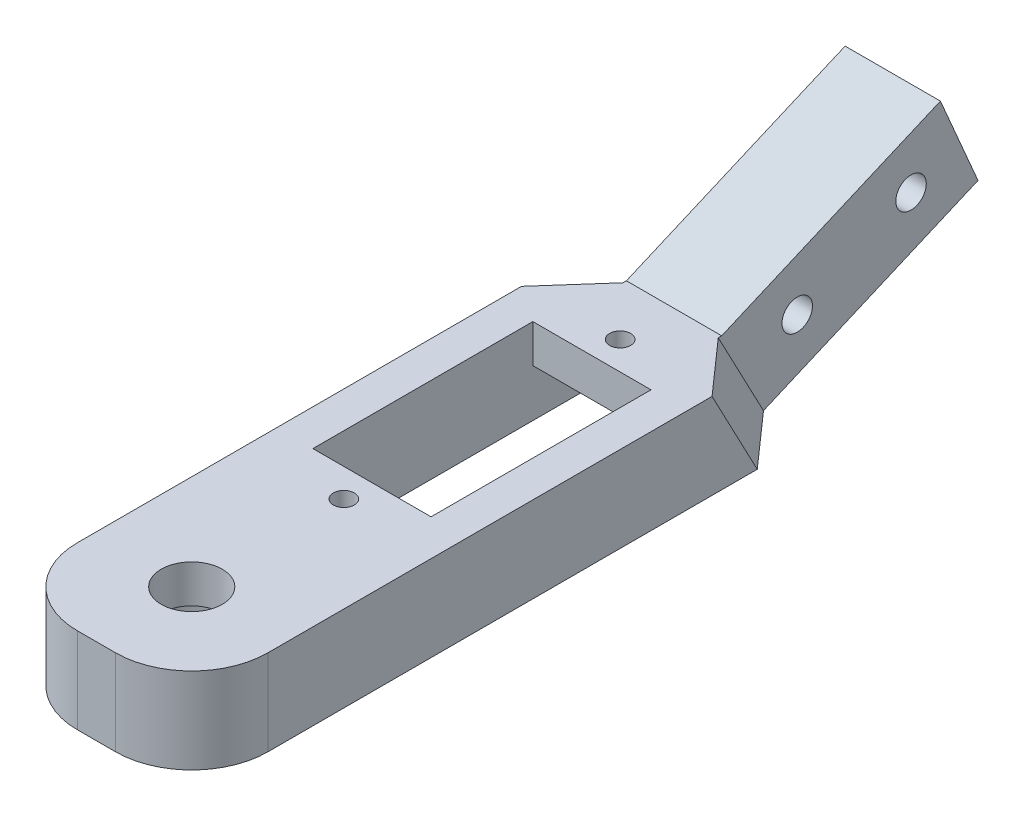
ISO-10303-21;
HEADER;
FILE_DESCRIPTION(('STEP AP214'),'2;1');
FILE_NAME('part.step','',(''),(''),'','','');
FILE_SCHEMA(('AUTOMOTIVE_DESIGN { 1 0 10303 214 1 1 1 1 }'));
ENDSEC;
DATA;
#1=APPLICATION_CONTEXT('core data for automotive mechanical design processes');
#2=APPLICATION_PROTOCOL_DEFINITION('international standard','automotive_design',2000,#1);
#3=PRODUCT_CONTEXT('',#1,'mechanical');
#4=PRODUCT('Part','Part','',(#3));
#5=PRODUCT_RELATED_PRODUCT_CATEGORY('part','',(#4));
#6=PRODUCT_DEFINITION_FORMATION('','',#4);
#7=PRODUCT_DEFINITION_CONTEXT('part definition',#1,'design');
#8=PRODUCT_DEFINITION('design','',#6,#7);
#9=PRODUCT_DEFINITION_SHAPE('','',#8);
#10=(LENGTH_UNIT() NAMED_UNIT(*) SI_UNIT(.MILLI.,.METRE.));
#11=(NAMED_UNIT(*) PLANE_ANGLE_UNIT() SI_UNIT($,.RADIAN.));
#12=(NAMED_UNIT(*) SI_UNIT($,.STERADIAN.) SOLID_ANGLE_UNIT());
#13=UNCERTAINTY_MEASURE_WITH_UNIT(LENGTH_MEASURE(1.E-05),#10,'distance_accuracy_value','');
#14=(GEOMETRIC_REPRESENTATION_CONTEXT(3) GLOBAL_UNCERTAINTY_ASSIGNED_CONTEXT((#13)) GLOBAL_UNIT_ASSIGNED_CONTEXT((#10,
#11,#12)) REPRESENTATION_CONTEXT('',''));
#15=CARTESIAN_POINT('',(0.,0.,0.));
#16=DIRECTION('',(0.,0.,1.));
#17=DIRECTION('',(1.,0.,0.));
#18=AXIS2_PLACEMENT_3D('',#15,#16,#17);
#19=CARTESIAN_POINT('',(6.2,-4.,-42.));
#20=DIRECTION('',(0.,0.,-1.));
#21=DIRECTION('',(0.,1.,0.));
#22=AXIS2_PLACEMENT_3D('',#19,#20,#21);
#23=PLANE('',#22);
#24=DIRECTION('',(-1.,0.,0.));
#25=VECTOR('',#24,1.);
#26=CARTESIAN_POINT('',(6.2,1.00000000000001,-42.));
#27=LINE('',#26,#25);
#28=CARTESIAN_POINT('',(6.2,1.00000000000001,-42.));
#29=VERTEX_POINT('',#28);
#30=CARTESIAN_POINT('',(-6.2,1.00000000000001,-42.));
#31=VERTEX_POINT('',#30);
#32=EDGE_CURVE('E278',#29,#31,#27,.T.);
#33=ORIENTED_EDGE('',*,*,#32,.F.);
#34=DIRECTION('',(0.,1.,0.));
#35=VECTOR('',#34,1.);
#36=CARTESIAN_POINT('',(6.2,-4.,-42.));
#37=LINE('',#36,#35);
#38=CARTESIAN_POINT('',(6.2,5.00000000000001,-42.));
#39=VERTEX_POINT('',#38);
#40=EDGE_CURVE('E262',#29,#39,#37,.T.);
#41=ORIENTED_EDGE('',*,*,#40,.T.);
#42=DIRECTION('',(-1.,0.,0.));
#43=VECTOR('',#42,1.);
#44=CARTESIAN_POINT('',(6.2,5.00000000000001,-42.));
#45=LINE('',#44,#43);
#46=CARTESIAN_POINT('',(-6.2,5.00000000000001,-42.));
#47=VERTEX_POINT('',#46);
#48=EDGE_CURVE('E265',#39,#47,#45,.T.);
#49=ORIENTED_EDGE('',*,*,#48,.T.);
#50=DIRECTION('',(0.,1.,0.));
#51=VECTOR('',#50,1.);
#52=CARTESIAN_POINT('',(-6.2,-4.,-42.));
#53=LINE('',#52,#51);
#54=EDGE_CURVE('E254',#31,#47,#53,.T.);
#55=ORIENTED_EDGE('',*,*,#54,.F.);
#56=EDGE_LOOP('',(#33,#41,#49,#55));
#57=FACE_BOUND('',#56,.T.);
#58=ADVANCED_FACE('F39',(#57),#23,.F.);
#59=CARTESIAN_POINT('',(6.2,-4.,-18.9147427120666));
#60=DIRECTION('',(0.,0.,1.));
#61=DIRECTION('',(0.,-1.,0.));
#62=AXIS2_PLACEMENT_3D('',#59,#60,#61);
#63=PLANE('',#62);
#64=DIRECTION('',(1.,0.,0.));
#65=VECTOR('',#64,1.);
#66=CARTESIAN_POINT('',(6.2,1.00000000000001,-18.9147427120666));
#67=LINE('',#66,#65);
#68=CARTESIAN_POINT('',(-6.2,1.00000000000001,-18.9147427120666));
#69=VERTEX_POINT('',#68);
#70=CARTESIAN_POINT('',(6.2,1.,-18.9147427120666));
#71=VERTEX_POINT('',#70);
#72=EDGE_CURVE('E228',#69,#71,#67,.T.);
#73=ORIENTED_EDGE('',*,*,#72,.F.);
#74=DIRECTION('',(0.,1.,0.));
#75=VECTOR('',#74,1.);
#76=CARTESIAN_POINT('',(-6.2,-4.,-18.9147427120666));
#77=LINE('',#76,#75);
#78=CARTESIAN_POINT('',(-6.2,5.00000000000001,-18.9147427120666));
#79=VERTEX_POINT('',#78);
#80=EDGE_CURVE('E257',#69,#79,#77,.T.);
#81=ORIENTED_EDGE('',*,*,#80,.T.);
#82=DIRECTION('',(1.,0.,0.));
#83=VECTOR('',#82,1.);
#84=CARTESIAN_POINT('',(6.2,5.,-18.9147427120666));
#85=LINE('',#84,#83);
#86=CARTESIAN_POINT('',(6.2,5.,-18.9147427120666));
#87=VERTEX_POINT('',#86);
#88=EDGE_CURVE('E272',#79,#87,#85,.T.);
#89=ORIENTED_EDGE('',*,*,#88,.T.);
#90=DIRECTION('',(0.,1.,0.));
#91=VECTOR('',#90,1.);
#92=CARTESIAN_POINT('',(6.2,-4.,-18.9147427120666));
#93=LINE('',#92,#91);
#94=EDGE_CURVE('E259',#71,#87,#93,.T.);
#95=ORIENTED_EDGE('',*,*,#94,.F.);
#96=EDGE_LOOP('',(#73,#81,#89,#95));
#97=FACE_BOUND('',#96,.T.);
#98=ADVANCED_FACE('F376',(#97),#63,.F.);
#99=CARTESIAN_POINT('',(10.,-3.99999999999999,10.));
#100=DIRECTION('',(0.,0.,-1.));
#101=DIRECTION('',(0.,1.,0.));
#102=AXIS2_PLACEMENT_3D('',#99,#100,#101);
#103=PLANE('',#102);
#104=DIRECTION('',(-1.,0.,0.));
#105=VECTOR('',#104,1.);
#106=CARTESIAN_POINT('',(10.,5.,10.));
#107=LINE('',#106,#105);
#108=CARTESIAN_POINT('',(2.,5.,10.));
#109=VERTEX_POINT('',#108);
#110=CARTESIAN_POINT('',(-2.,5.,10.));
#111=VERTEX_POINT('',#110);
#112=EDGE_CURVE('E233',#109,#111,#107,.T.);
#113=ORIENTED_EDGE('',*,*,#112,.T.);
#114=DIRECTION('',(0.,-1.,0.));
#115=VECTOR('',#114,1.);
#116=CARTESIAN_POINT('',(-2.,-3.99999999999999,10.));
#117=LINE('',#116,#115);
#118=CARTESIAN_POINT('',(-2.,-3.99999999999999,10.));
#119=VERTEX_POINT('',#118);
#120=EDGE_CURVE('E223',#111,#119,#117,.T.);
#121=ORIENTED_EDGE('',*,*,#120,.T.);
#122=DIRECTION('',(-1.,0.,0.));
#123=VECTOR('',#122,1.);
#124=CARTESIAN_POINT('',(10.,-3.99999999999999,10.));
#125=LINE('',#124,#123);
#126=CARTESIAN_POINT('',(2.,-3.99999999999999,10.));
#127=VERTEX_POINT('',#126);
#128=EDGE_CURVE('E230',#127,#119,#125,.T.);
#129=ORIENTED_EDGE('',*,*,#128,.F.);
#130=DIRECTION('',(0.,-1.,0.));
#131=VECTOR('',#130,1.);
#132=CARTESIAN_POINT('',(2.,5.,10.));
#133=LINE('',#132,#131);
#134=EDGE_CURVE('E226',#127,#109,#133,.F.);
#135=ORIENTED_EDGE('',*,*,#134,.T.);
#136=EDGE_LOOP('',(#113,#121,#129,#135));
#137=FACE_BOUND('',#136,.T.);
#138=ADVANCED_FACE('F382',(#137),#103,.F.);
#139=CARTESIAN_POINT('',(10.,-3.99999999999999,-55.));
#140=DIRECTION('',(0.,1.,0.));
#141=DIRECTION('',(0.,0.,1.));
#142=AXIS2_PLACEMENT_3D('',#139,#140,#141);
#143=PLANE('',#142);
#144=DIRECTION('',(0.,0.,1.));
#145=VECTOR('',#144,1.);
#146=CARTESIAN_POINT('',(-6.2,-4.,-42.));
#147=LINE('',#146,#145);
#148=CARTESIAN_POINT('',(-6.2,-3.99999999999998,-47.9147427120666));
#149=VERTEX_POINT('',#148);
#150=CARTESIAN_POINT('',(-6.2,-3.99999999999999,-13.));
#151=VERTEX_POINT('',#150);
#152=EDGE_CURVE('E268',#149,#151,#147,.T.);
#153=ORIENTED_EDGE('',*,*,#152,.T.);
#154=DIRECTION('',(-1.,0.,0.));
#155=VECTOR('',#154,1.);
#156=CARTESIAN_POINT('',(6.2,-3.99999999999999,-13.));
#157=LINE('',#156,#155);
#158=CARTESIAN_POINT('',(6.2,-3.99999999999999,-13.));
#159=VERTEX_POINT('',#158);
#160=EDGE_CURVE('E289',#159,#151,#157,.T.);
#161=ORIENTED_EDGE('',*,*,#160,.F.);
#162=DIRECTION('',(0.,0.,-1.));
#163=VECTOR('',#162,1.);
#164=CARTESIAN_POINT('',(6.2,-4.,-42.));
#165=LINE('',#164,#163);
#166=CARTESIAN_POINT('',(6.2,-3.99999999999998,-47.9147427120666));
#167=VERTEX_POINT('',#166);
#168=EDGE_CURVE('E260',#159,#167,#165,.T.);
#169=ORIENTED_EDGE('',*,*,#168,.T.);
#170=DIRECTION('',(1.,0.,0.));
#171=VECTOR('',#170,1.);
#172=CARTESIAN_POINT('',(6.2,-3.99999999999998,-47.9147427120666));
#173=LINE('',#172,#171);
#174=EDGE_CURVE('E301',#149,#167,#173,.T.);
#175=ORIENTED_EDGE('',*,*,#174,.F.);
#176=EDGE_LOOP('',(#153,#161,#169,#175));
#177=FACE_BOUND('',#176,.T.);
#178=CARTESIAN_POINT('',(0.,-3.99999999999999,0.));
#179=DIRECTION('',(0.,1.,0.));
#180=DIRECTION('',(0.,0.,1.));
#181=AXIS2_PLACEMENT_3D('',#178,#179,#180);
#182=CIRCLE('',#181,6.7);
#183=CARTESIAN_POINT('',(0.,-3.99999999999999,6.7));
#184=VERTEX_POINT('',#183);
#185=EDGE_CURVE('E245',#184,#184,#182,.T.);
#186=ORIENTED_EDGE('',*,*,#185,.T.);
#187=EDGE_LOOP('',(#186));
#188=FACE_BOUND('',#187,.T.);
#189=DIRECTION('',(0.,0.,-1.));
#190=VECTOR('',#189,1.);
#191=CARTESIAN_POINT('',(-10.,-3.99999999999999,-55.));
#192=LINE('',#191,#190);
#193=CARTESIAN_POINT('',(-10.,-3.99999999999999,2.));
#194=VERTEX_POINT('',#193);
#195=CARTESIAN_POINT('',(-10.,-3.99999999999999,-49.3479877694642));
#196=VERTEX_POINT('',#195);
#197=EDGE_CURVE('E240',#194,#196,#192,.T.);
#198=ORIENTED_EDGE('',*,*,#197,.T.);
#199=DIRECTION('',(-0.662584514956001,0.,0.748987156458988));
#200=VECTOR('',#199,1.);
#201=CARTESIAN_POINT('',(-5.00000000000001,-3.99999999999999,-55.));
#202=LINE('',#201,#200);
#203=CARTESIAN_POINT('',(-5.,-3.99999999999999,-55.));
#204=VERTEX_POINT('',#203);
#205=EDGE_CURVE('E47',#196,#204,#202,.F.);
#206=ORIENTED_EDGE('',*,*,#205,.T.);
#207=DIRECTION('',(-1.,0.,0.));
#208=VECTOR('',#207,1.);
#209=CARTESIAN_POINT('',(5.,-3.99999999999999,-55.));
#210=LINE('',#209,#208);
#211=CARTESIAN_POINT('',(5.,-3.99999999999999,-55.));
#212=VERTEX_POINT('',#211);
#213=EDGE_CURVE('E171',#212,#204,#210,.T.);
#214=ORIENTED_EDGE('',*,*,#213,.F.);
#215=DIRECTION('',(0.662584514956004,0.,0.748987156458986));
#216=VECTOR('',#215,1.);
#217=CARTESIAN_POINT('',(16.1431565790713,-3.99999999999999,-42.4037485456629));
#218=LINE('',#217,#216);
#219=CARTESIAN_POINT('',(10.,-3.99999999999999,-49.3479877694642));
#220=VERTEX_POINT('',#219);
#221=EDGE_CURVE('E54',#212,#220,#218,.T.);
#222=ORIENTED_EDGE('',*,*,#221,.T.);
#223=DIRECTION('',(0.,0.,-1.));
#224=VECTOR('',#223,1.);
#225=CARTESIAN_POINT('',(10.,-3.99999999999999,-55.));
#226=LINE('',#225,#224);
#227=CARTESIAN_POINT('',(10.,-3.99999999999999,2.));
#228=VERTEX_POINT('',#227);
#229=EDGE_CURVE('E239',#228,#220,#226,.T.);
#230=ORIENTED_EDGE('',*,*,#229,.F.);
#231=CARTESIAN_POINT('',(2.,-3.99999999999999,2.));
#232=DIRECTION('',(0.,1.,0.));
#233=DIRECTION('',(0.,0.,1.));
#234=AXIS2_PLACEMENT_3D('',#231,#232,#233);
#235=CIRCLE('',#234,8.);
#236=EDGE_CURVE('E221',#228,#127,#235,.F.);
#237=ORIENTED_EDGE('',*,*,#236,.T.);
#238=ORIENTED_EDGE('',*,*,#128,.T.);
#239=CARTESIAN_POINT('',(-2.,-3.99999999999999,2.));
#240=DIRECTION('',(0.,1.,0.));
#241=DIRECTION('',(0.,0.,1.));
#242=AXIS2_PLACEMENT_3D('',#239,#240,#241);
#243=CIRCLE('',#242,8.);
#244=EDGE_CURVE('E219',#119,#194,#243,.F.);
#245=ORIENTED_EDGE('',*,*,#244,.T.);
#246=EDGE_LOOP('',(#198,#206,#214,#222,#230,#237,#238,#245));
#247=FACE_BOUND('',#246,.T.);
#248=ADVANCED_FACE('F173',(#177,#188,#247),#143,.F.);
#249=CARTESIAN_POINT('',(10.,5.00000000000001,-50.2563110448336));
#250=DIRECTION('',(0.,-1.,0.));
#251=DIRECTION('',(0.,0.,-1.));
#252=AXIS2_PLACEMENT_3D('',#249,#250,#251);
#253=PLANE('',#252);
#254=CARTESIAN_POINT('',(0.,5.00000000000002,-15.9573713560333));
#255=DIRECTION('',(0.,-1.,0.));
#256=DIRECTION('',(0.,0.,-1.));
#257=AXIS2_PLACEMENT_3D('',#254,#255,#256);
#258=CIRCLE('',#257,1.1);
#259=CARTESIAN_POINT('',(0.,5.00000000000002,-17.0573713560333));
#260=VERTEX_POINT('',#259);
#261=EDGE_CURVE('E304',#260,#260,#258,.T.);
#262=ORIENTED_EDGE('',*,*,#261,.T.);
#263=EDGE_LOOP('',(#262));
#264=FACE_BOUND('',#263,.T.);
#265=CARTESIAN_POINT('',(0.,5.00000000000002,-44.9573713560333));
#266=DIRECTION('',(0.,-1.,0.));
#267=DIRECTION('',(0.,0.,1.));
#268=AXIS2_PLACEMENT_3D('',#265,#266,#267);
#269=CIRCLE('',#268,1.1);
#270=CARTESIAN_POINT('',(0.,5.00000000000002,-43.8573713560333));
#271=VERTEX_POINT('',#270);
#272=EDGE_CURVE('E315',#271,#271,#269,.T.);
#273=ORIENTED_EDGE('',*,*,#272,.T.);
#274=EDGE_LOOP('',(#273));
#275=FACE_BOUND('',#274,.T.);
#276=ORIENTED_EDGE('',*,*,#88,.F.);
#277=DIRECTION('',(0.,0.,1.));
#278=VECTOR('',#277,1.);
#279=CARTESIAN_POINT('',(-6.2,5.00000000000001,-42.));
#280=LINE('',#279,#278);
#281=EDGE_CURVE('E275',#47,#79,#280,.T.);
#282=ORIENTED_EDGE('',*,*,#281,.F.);
#283=ORIENTED_EDGE('',*,*,#48,.F.);
#284=DIRECTION('',(0.,0.,-1.));
#285=VECTOR('',#284,1.);
#286=CARTESIAN_POINT('',(6.2,5.00000000000001,-42.));
#287=LINE('',#286,#285);
#288=EDGE_CURVE('E269',#87,#39,#287,.T.);
#289=ORIENTED_EDGE('',*,*,#288,.F.);
#290=EDGE_LOOP('',(#276,#282,#283,#289));
#291=FACE_BOUND('',#290,.T.);
#292=CARTESIAN_POINT('',(0.,5.00000000000001,0.));
#293=DIRECTION('',(0.,-1.,0.));
#294=DIRECTION('',(0.,0.,-1.));
#295=AXIS2_PLACEMENT_3D('',#292,#293,#294);
#296=CIRCLE('',#295,3.2);
#297=CARTESIAN_POINT('',(0.,5.00000000000001,-3.2));
#298=VERTEX_POINT('',#297);
#299=EDGE_CURVE('E248',#298,#298,#296,.T.);
#300=ORIENTED_EDGE('',*,*,#299,.T.);
#301=EDGE_LOOP('',(#300));
#302=FACE_BOUND('',#301,.T.);
#303=DIRECTION('',(0.,0.,1.));
#304=VECTOR('',#303,1.);
#305=CARTESIAN_POINT('',(-5.,5.00000000000001,-50.6149090718966));
#306=LINE('',#305,#304);
#307=CARTESIAN_POINT('',(-5.,5.00000000000001,-50.6149090718966));
#308=VERTEX_POINT('',#307);
#309=CARTESIAN_POINT('',(-5.,5.00000000000001,-50.2563110448336));
#310=VERTEX_POINT('',#309);
#311=EDGE_CURVE('E198',#308,#310,#306,.T.);
#312=ORIENTED_EDGE('',*,*,#311,.T.);
#313=DIRECTION('',(0.662584514956001,0.,-0.748987156458988));
#314=VECTOR('',#313,1.);
#315=CARTESIAN_POINT('',(-2.64586232921722,5.00000000000001,-52.9174340263595));
#316=LINE('',#315,#314);
#317=CARTESIAN_POINT('',(-10.,5.00000000000001,-44.6042988142978));
#318=VERTEX_POINT('',#317);
#319=EDGE_CURVE('E202',#310,#318,#316,.F.);
#320=ORIENTED_EDGE('',*,*,#319,.T.);
#321=DIRECTION('',(0.,0.,1.));
#322=VECTOR('',#321,1.);
#323=CARTESIAN_POINT('',(-10.,5.00000000000001,-50.2563110448336));
#324=LINE('',#323,#322);
#325=CARTESIAN_POINT('',(-10.,5.,2.));
#326=VERTEX_POINT('',#325);
#327=EDGE_CURVE('E237',#318,#326,#324,.T.);
#328=ORIENTED_EDGE('',*,*,#327,.T.);
#329=CARTESIAN_POINT('',(-2.,5.,2.));
#330=DIRECTION('',(0.,-1.,0.));
#331=DIRECTION('',(0.,0.,-1.));
#332=AXIS2_PLACEMENT_3D('',#329,#330,#331);
#333=CIRCLE('',#332,8.);
#334=EDGE_CURVE('E211',#326,#111,#333,.F.);
#335=ORIENTED_EDGE('',*,*,#334,.T.);
#336=ORIENTED_EDGE('',*,*,#112,.F.);
#337=CARTESIAN_POINT('',(2.,5.,2.));
#338=DIRECTION('',(0.,-1.,0.));
#339=DIRECTION('',(0.,0.,-1.));
#340=AXIS2_PLACEMENT_3D('',#337,#338,#339);
#341=CIRCLE('',#340,8.);
#342=CARTESIAN_POINT('',(10.,5.,2.));
#343=VERTEX_POINT('',#342);
#344=EDGE_CURVE('E213',#109,#343,#341,.F.);
#345=ORIENTED_EDGE('',*,*,#344,.T.);
#346=DIRECTION('',(0.,0.,1.));
#347=VECTOR('',#346,1.);
#348=CARTESIAN_POINT('',(10.,5.00000000000001,-50.2563110448336));
#349=LINE('',#348,#347);
#350=CARTESIAN_POINT('',(10.,5.00000000000001,-44.6042988142978));
#351=VERTEX_POINT('',#350);
#352=EDGE_CURVE('E236',#351,#343,#349,.T.);
#353=ORIENTED_EDGE('',*,*,#352,.F.);
#354=DIRECTION('',(-0.662584514956004,0.,-0.748987156458986));
#355=VECTOR('',#354,1.);
#356=CARTESIAN_POINT('',(13.7890189082885,5.00000000000001,-40.3211825720223));
#357=LINE('',#356,#355);
#358=CARTESIAN_POINT('',(5.,5.00000000000001,-50.2563110448336));
#359=VERTEX_POINT('',#358);
#360=EDGE_CURVE('E206',#351,#359,#357,.T.);
#361=ORIENTED_EDGE('',*,*,#360,.T.);
#362=DIRECTION('',(0.,0.,1.));
#363=VECTOR('',#362,1.);
#364=CARTESIAN_POINT('',(5.,5.00000000000001,-50.6149090718966));
#365=LINE('',#364,#363);
#366=CARTESIAN_POINT('',(5.,5.00000000000001,-50.6149090718966));
#367=VERTEX_POINT('',#366);
#368=EDGE_CURVE('E196',#367,#359,#365,.T.);
#369=ORIENTED_EDGE('',*,*,#368,.F.);
#370=DIRECTION('',(-1.,0.,0.));
#371=VECTOR('',#370,1.);
#372=CARTESIAN_POINT('',(5.,5.00000000000001,-50.6149090718966));
#373=LINE('',#372,#371);
#374=EDGE_CURVE('E327',#367,#308,#373,.T.);
#375=ORIENTED_EDGE('',*,*,#374,.T.);
#376=EDGE_LOOP('',(#312,#320,#328,#335,#336,#345,#353,#361,#369,#375));
#377=FACE_BOUND('',#376,.T.);
#378=ADVANCED_FACE('F415',(#264,#275,#291,#302,#377),#253,.F.);
#379=CARTESIAN_POINT('',(10.,0.,0.));
#380=DIRECTION('',(1.,0.,0.));
#381=DIRECTION('',(0.,0.,-1.));
#382=AXIS2_PLACEMENT_3D('',#379,#380,#381);
#383=PLANE('',#382);
#384=ORIENTED_EDGE('',*,*,#229,.T.);
#385=DIRECTION('',(0.,0.884640690086766,0.466273363428376));
#386=VECTOR('',#385,1.);
#387=CARTESIAN_POINT('',(10.,2.66863318285813,-45.8331075943997));
#388=LINE('',#387,#386);
#389=EDGE_CURVE('E12',#220,#351,#388,.T.);
#390=ORIENTED_EDGE('',*,*,#389,.T.);
#391=ORIENTED_EDGE('',*,*,#352,.T.);
#392=DIRECTION('',(0.,-1.,0.));
#393=VECTOR('',#392,1.);
#394=CARTESIAN_POINT('',(10.,-3.99999999999999,2.));
#395=LINE('',#394,#393);
#396=EDGE_CURVE('E208',#343,#228,#395,.T.);
#397=ORIENTED_EDGE('',*,*,#396,.T.);
#398=EDGE_LOOP('',(#384,#390,#391,#397));
#399=FACE_BOUND('',#398,.T.);
#400=ADVANCED_FACE('F412',(#399),#383,.T.);
#401=CARTESIAN_POINT('',(-10.,0.,0.));
#402=DIRECTION('',(1.,0.,0.));
#403=DIRECTION('',(0.,0.,-1.));
#404=AXIS2_PLACEMENT_3D('',#401,#402,#403);
#405=PLANE('',#404);
#406=ORIENTED_EDGE('',*,*,#327,.F.);
#407=DIRECTION('',(0.,-0.884640690086766,-0.466273363428376));
#408=VECTOR('',#407,1.);
#409=CARTESIAN_POINT('',(-10.,19.4856312346664,-36.9692622702422));
#410=LINE('',#409,#408);
#411=EDGE_CURVE('E62',#318,#196,#410,.T.);
#412=ORIENTED_EDGE('',*,*,#411,.T.);
#413=ORIENTED_EDGE('',*,*,#197,.F.);
#414=DIRECTION('',(0.,-1.,0.));
#415=VECTOR('',#414,1.);
#416=CARTESIAN_POINT('',(-10.,0.,2.));
#417=LINE('',#416,#415);
#418=EDGE_CURVE('E216',#194,#326,#417,.F.);
#419=ORIENTED_EDGE('',*,*,#418,.T.);
#420=EDGE_LOOP('',(#406,#412,#413,#419));
#421=FACE_BOUND('',#420,.T.);
#422=ADVANCED_FACE('F410',(#421),#405,.F.);
#423=CARTESIAN_POINT('',(0.,1.00000000000001,0.));
#424=DIRECTION('',(0.,-1.,0.));
#425=DIRECTION('',(0.,0.,-1.));
#426=AXIS2_PLACEMENT_3D('',#423,#424,#425);
#427=CYLINDRICAL_SURFACE('',#426,6.7);
#428=CARTESIAN_POINT('',(0.,1.00000000000001,0.));
#429=DIRECTION('',(0.,1.,0.));
#430=DIRECTION('',(0.,0.,1.));
#431=AXIS2_PLACEMENT_3D('',#428,#429,#430);
#432=CIRCLE('',#431,6.7);
#433=CARTESIAN_POINT('',(0.,1.00000000000001,6.7));
#434=VERTEX_POINT('',#433);
#435=EDGE_CURVE('E242',#434,#434,#432,.T.);
#436=ORIENTED_EDGE('',*,*,#435,.T.);
#437=EDGE_LOOP('',(#436));
#438=FACE_BOUND('',#437,.T.);
#439=ORIENTED_EDGE('',*,*,#185,.F.);
#440=EDGE_LOOP('',(#439));
#441=FACE_BOUND('',#440,.T.);
#442=ADVANCED_FACE('F406',(#438,#441),#427,.F.);
#443=CARTESIAN_POINT('',(0.,1.00000000000001,0.));
#444=DIRECTION('',(0.,1.,0.));
#445=DIRECTION('',(0.,0.,1.));
#446=AXIS2_PLACEMENT_3D('',#443,#444,#445);
#447=PLANE('',#446);
#448=CARTESIAN_POINT('',(0.,1.00000000000001,0.));
#449=DIRECTION('',(0.,-1.,0.));
#450=DIRECTION('',(0.,0.,-1.));
#451=AXIS2_PLACEMENT_3D('',#448,#449,#450);
#452=CIRCLE('',#451,3.2);
#453=CARTESIAN_POINT('',(0.,1.00000000000001,-3.2));
#454=VERTEX_POINT('',#453);
#455=EDGE_CURVE('E251',#454,#454,#452,.T.);
#456=ORIENTED_EDGE('',*,*,#455,.F.);
#457=EDGE_LOOP('',(#456));
#458=FACE_BOUND('',#457,.T.);
#459=ORIENTED_EDGE('',*,*,#435,.F.);
#460=EDGE_LOOP('',(#459));
#461=FACE_BOUND('',#460,.T.);
#462=ADVANCED_FACE('F402',(#458,#461),#447,.F.);
#463=CARTESIAN_POINT('',(0.,5.00000000000001,0.));
#464=DIRECTION('',(0.,-1.,0.));
#465=DIRECTION('',(0.,0.,-1.));
#466=AXIS2_PLACEMENT_3D('',#463,#464,#465);
#467=CYLINDRICAL_SURFACE('',#466,3.2);
#468=ORIENTED_EDGE('',*,*,#299,.F.);
#469=EDGE_LOOP('',(#468));
#470=FACE_BOUND('',#469,.T.);
#471=ORIENTED_EDGE('',*,*,#455,.T.);
#472=EDGE_LOOP('',(#471));
#473=FACE_BOUND('',#472,.T.);
#474=ADVANCED_FACE('F398',(#470,#473),#467,.F.);
#475=CARTESIAN_POINT('',(-6.2,-4.,-42.));
#476=DIRECTION('',(-1.,0.,0.));
#477=DIRECTION('',(0.,0.,1.));
#478=AXIS2_PLACEMENT_3D('',#475,#476,#477);
#479=PLANE('',#478);
#480=ORIENTED_EDGE('',*,*,#152,.F.);
#481=DIRECTION('',(0.,-1.,0.));
#482=VECTOR('',#481,1.);
#483=CARTESIAN_POINT('',(-6.2,42.0513057617381,-47.9147427120666));
#484=LINE('',#483,#482);
#485=CARTESIAN_POINT('',(-6.2,1.00000000000001,-47.9147427120666));
#486=VERTEX_POINT('',#485);
#487=EDGE_CURVE('E285',#486,#149,#484,.T.);
#488=ORIENTED_EDGE('',*,*,#487,.F.);
#489=DIRECTION('',(0.,0.,1.));
#490=VECTOR('',#489,1.);
#491=CARTESIAN_POINT('',(-6.2,1.00000000000001,-47.9147427120666));
#492=LINE('',#491,#490);
#493=EDGE_CURVE('E284',#486,#31,#492,.T.);
#494=ORIENTED_EDGE('',*,*,#493,.T.);
#495=ORIENTED_EDGE('',*,*,#54,.T.);
#496=ORIENTED_EDGE('',*,*,#281,.T.);
#497=ORIENTED_EDGE('',*,*,#80,.F.);
#498=CARTESIAN_POINT('',(-6.2,1.,-13.));
#499=VERTEX_POINT('',#498);
#500=EDGE_CURVE('E307',#69,#499,#492,.T.);
#501=ORIENTED_EDGE('',*,*,#500,.T.);
#502=DIRECTION('',(0.,-1.,0.));
#503=VECTOR('',#502,1.);
#504=CARTESIAN_POINT('',(-6.2,42.0513057617381,-13.));
#505=LINE('',#504,#503);
#506=EDGE_CURVE('E295',#499,#151,#505,.T.);
#507=ORIENTED_EDGE('',*,*,#506,.T.);
#508=EDGE_LOOP('',(#480,#488,#494,#495,#496,#497,#501,#507));
#509=FACE_BOUND('',#508,.T.);
#510=ADVANCED_FACE('F393',(#509),#479,.F.);
#511=CARTESIAN_POINT('',(6.2,-4.,-42.));
#512=DIRECTION('',(1.,0.,0.));
#513=DIRECTION('',(0.,0.,-1.));
#514=AXIS2_PLACEMENT_3D('',#511,#512,#513);
#515=PLANE('',#514);
#516=ORIENTED_EDGE('',*,*,#168,.F.);
#517=DIRECTION('',(0.,-1.,0.));
#518=VECTOR('',#517,1.);
#519=CARTESIAN_POINT('',(6.2,42.0513057617381,-13.));
#520=LINE('',#519,#518);
#521=CARTESIAN_POINT('',(6.2,1.,-13.));
#522=VERTEX_POINT('',#521);
#523=EDGE_CURVE('E292',#522,#159,#520,.T.);
#524=ORIENTED_EDGE('',*,*,#523,.F.);
#525=DIRECTION('',(0.,0.,-1.));
#526=VECTOR('',#525,1.);
#527=CARTESIAN_POINT('',(6.2,1.00000000000001,-47.9147427120666));
#528=LINE('',#527,#526);
#529=EDGE_CURVE('E310',#522,#71,#528,.T.);
#530=ORIENTED_EDGE('',*,*,#529,.T.);
#531=ORIENTED_EDGE('',*,*,#94,.T.);
#532=ORIENTED_EDGE('',*,*,#288,.T.);
#533=ORIENTED_EDGE('',*,*,#40,.F.);
#534=CARTESIAN_POINT('',(6.2,1.00000000000001,-47.9147427120666));
#535=VERTEX_POINT('',#534);
#536=EDGE_CURVE('E298',#29,#535,#528,.T.);
#537=ORIENTED_EDGE('',*,*,#536,.T.);
#538=DIRECTION('',(0.,-1.,0.));
#539=VECTOR('',#538,1.);
#540=CARTESIAN_POINT('',(6.2,42.0513057617381,-47.9147427120666));
#541=LINE('',#540,#539);
#542=EDGE_CURVE('E288',#535,#167,#541,.T.);
#543=ORIENTED_EDGE('',*,*,#542,.T.);
#544=EDGE_LOOP('',(#516,#524,#530,#531,#532,#533,#537,#543));
#545=FACE_BOUND('',#544,.T.);
#546=ADVANCED_FACE('F390',(#545),#515,.F.);
#547=CARTESIAN_POINT('',(10.,1.00000000000001,-50.2563110448336));
#548=DIRECTION('',(0.,-1.,0.));
#549=DIRECTION('',(0.,0.,-1.));
#550=AXIS2_PLACEMENT_3D('',#547,#548,#549);
#551=PLANE('',#550);
#552=CARTESIAN_POINT('',(0.,1.,-15.9573713560333));
#553=DIRECTION('',(0.,-1.,0.));
#554=DIRECTION('',(0.,0.,-1.));
#555=AXIS2_PLACEMENT_3D('',#552,#553,#554);
#556=CIRCLE('',#555,1.1);
#557=CARTESIAN_POINT('',(0.,1.,-17.0573713560333));
#558=VERTEX_POINT('',#557);
#559=EDGE_CURVE('E318',#558,#558,#556,.T.);
#560=ORIENTED_EDGE('',*,*,#559,.F.);
#561=EDGE_LOOP('',(#560));
#562=FACE_BOUND('',#561,.T.);
#563=ORIENTED_EDGE('',*,*,#72,.T.);
#564=ORIENTED_EDGE('',*,*,#529,.F.);
#565=DIRECTION('',(1.,0.,0.));
#566=VECTOR('',#565,1.);
#567=CARTESIAN_POINT('',(6.2,1.,-13.));
#568=LINE('',#567,#566);
#569=EDGE_CURVE('E308',#499,#522,#568,.T.);
#570=ORIENTED_EDGE('',*,*,#569,.F.);
#571=ORIENTED_EDGE('',*,*,#500,.F.);
#572=EDGE_LOOP('',(#563,#564,#570,#571));
#573=FACE_BOUND('',#572,.T.);
#574=ADVANCED_FACE('F392',(#562,#573),#551,.T.);
#575=CARTESIAN_POINT('',(6.2,42.0513057617381,-13.));
#576=DIRECTION('',(0.,0.,1.));
#577=DIRECTION('',(0.,-1.,0.));
#578=AXIS2_PLACEMENT_3D('',#575,#576,#577);
#579=PLANE('',#578);
#580=ORIENTED_EDGE('',*,*,#569,.T.);
#581=ORIENTED_EDGE('',*,*,#523,.T.);
#582=ORIENTED_EDGE('',*,*,#160,.T.);
#583=ORIENTED_EDGE('',*,*,#506,.F.);
#584=EDGE_LOOP('',(#580,#581,#582,#583));
#585=FACE_BOUND('',#584,.T.);
#586=ADVANCED_FACE('F482',(#585),#579,.F.);
#587=CARTESIAN_POINT('',(0.,1.00000000000001,-44.9573713560333));
#588=DIRECTION('',(0.,-1.,0.));
#589=DIRECTION('',(0.,0.,1.));
#590=AXIS2_PLACEMENT_3D('',#587,#588,#589);
#591=CIRCLE('',#590,1.1);
#592=CARTESIAN_POINT('',(0.,1.00000000000001,-43.8573713560333));
#593=VERTEX_POINT('',#592);
#594=EDGE_CURVE('E178',#593,#593,#591,.T.);
#595=ORIENTED_EDGE('',*,*,#594,.F.);
#596=EDGE_LOOP('',(#595));
#597=FACE_BOUND('',#596,.T.);
#598=ORIENTED_EDGE('',*,*,#32,.T.);
#599=ORIENTED_EDGE('',*,*,#493,.F.);
#600=DIRECTION('',(-1.,0.,0.));
#601=VECTOR('',#600,1.);
#602=CARTESIAN_POINT('',(6.2,1.00000000000001,-47.9147427120666));
#603=LINE('',#602,#601);
#604=EDGE_CURVE('E282',#535,#486,#603,.T.);
#605=ORIENTED_EDGE('',*,*,#604,.F.);
#606=ORIENTED_EDGE('',*,*,#536,.F.);
#607=EDGE_LOOP('',(#598,#599,#605,#606));
#608=FACE_BOUND('',#607,.T.);
#609=ADVANCED_FACE('F480',(#597,#608),#551,.T.);
#610=CARTESIAN_POINT('',(6.2,42.0513057617381,-47.9147427120666));
#611=DIRECTION('',(0.,0.,-1.));
#612=DIRECTION('',(0.,1.,0.));
#613=AXIS2_PLACEMENT_3D('',#610,#611,#612);
#614=PLANE('',#613);
#615=ORIENTED_EDGE('',*,*,#604,.T.);
#616=ORIENTED_EDGE('',*,*,#487,.T.);
#617=ORIENTED_EDGE('',*,*,#174,.T.);
#618=ORIENTED_EDGE('',*,*,#542,.F.);
#619=EDGE_LOOP('',(#615,#616,#617,#618));
#620=FACE_BOUND('',#619,.T.);
#621=ADVANCED_FACE('F388',(#620),#614,.F.);
#622=CARTESIAN_POINT('',(0.,5.00000000000002,-44.9573713560333));
#623=DIRECTION('',(0.,-1.,0.));
#624=DIRECTION('',(0.,0.,-1.));
#625=AXIS2_PLACEMENT_3D('',#622,#623,#624);
#626=CYLINDRICAL_SURFACE('',#625,1.1);
#627=ORIENTED_EDGE('',*,*,#272,.F.);
#628=EDGE_LOOP('',(#627));
#629=FACE_BOUND('',#628,.T.);
#630=ORIENTED_EDGE('',*,*,#594,.T.);
#631=EDGE_LOOP('',(#630));
#632=FACE_BOUND('',#631,.T.);
#633=ADVANCED_FACE('F475',(#629,#632),#626,.F.);
#634=CARTESIAN_POINT('',(0.,5.00000000000002,-15.9573713560333));
#635=DIRECTION('',(0.,-1.,0.));
#636=DIRECTION('',(0.,0.,-1.));
#637=AXIS2_PLACEMENT_3D('',#634,#635,#636);
#638=CYLINDRICAL_SURFACE('',#637,1.1);
#639=ORIENTED_EDGE('',*,*,#261,.F.);
#640=EDGE_LOOP('',(#639));
#641=FACE_BOUND('',#640,.T.);
#642=ORIENTED_EDGE('',*,*,#559,.T.);
#643=EDGE_LOOP('',(#642));
#644=FACE_BOUND('',#643,.T.);
#645=ADVANCED_FACE('F429',(#641,#644),#638,.F.);
#646=CARTESIAN_POINT('',(-2.,-3.99999999999999,2.));
#647=DIRECTION('',(0.,-1.,0.));
#648=DIRECTION('',(0.,0.,-1.));
#649=AXIS2_PLACEMENT_3D('',#646,#647,#648);
#650=CYLINDRICAL_SURFACE('',#649,8.);
#651=ORIENTED_EDGE('',*,*,#334,.F.);
#652=ORIENTED_EDGE('',*,*,#418,.F.);
#653=ORIENTED_EDGE('',*,*,#244,.F.);
#654=ORIENTED_EDGE('',*,*,#120,.F.);
#655=EDGE_LOOP('',(#651,#652,#653,#654));
#656=FACE_BOUND('',#655,.T.);
#657=ADVANCED_FACE('F370',(#656),#650,.T.);
#658=CARTESIAN_POINT('',(2.,0.,2.));
#659=DIRECTION('',(0.,1.,0.));
#660=DIRECTION('',(0.,0.,1.));
#661=AXIS2_PLACEMENT_3D('',#658,#659,#660);
#662=CYLINDRICAL_SURFACE('',#661,8.);
#663=ORIENTED_EDGE('',*,*,#344,.F.);
#664=ORIENTED_EDGE('',*,*,#134,.F.);
#665=ORIENTED_EDGE('',*,*,#236,.F.);
#666=ORIENTED_EDGE('',*,*,#396,.F.);
#667=EDGE_LOOP('',(#663,#664,#665,#666));
#668=FACE_BOUND('',#667,.T.);
#669=ADVANCED_FACE('F361',(#668),#662,.T.);
#670=CARTESIAN_POINT('',(5.,0.,0.));
#671=DIRECTION('',(1.,0.,0.));
#672=DIRECTION('',(0.,0.,-1.));
#673=AXIS2_PLACEMENT_3D('',#670,#671,#672);
#674=PLANE('',#673);
#675=CARTESIAN_POINT('',(5.,8.09056718541833,-70.4860642235167));
#676=DIRECTION('',(1.,0.,0.));
#677=DIRECTION('',(0.,0.,-1.));
#678=AXIS2_PLACEMENT_3D('',#675,#676,#677);
#679=CIRCLE('',#678,1.6);
#680=CARTESIAN_POINT('',(5.,8.09056718541833,-72.0860642235168));
#681=VERTEX_POINT('',#680);
#682=EDGE_CURVE('E340',#681,#681,#679,.T.);
#683=ORIENTED_EDGE('',*,*,#682,.F.);
#684=EDGE_LOOP('',(#683));
#685=FACE_BOUND('',#684,.T.);
#686=DIRECTION('',(0.,-0.884640690086766,-0.466273363428376));
#687=VECTOR('',#686,1.);
#688=CARTESIAN_POINT('',(5.,5.00000000000001,-50.2563110448336));
#689=LINE('',#688,#687);
#690=EDGE_CURVE('E189',#359,#212,#689,.T.);
#691=ORIENTED_EDGE('',*,*,#690,.T.);
#692=DIRECTION('',(0.,0.394534858563121,-0.918880974543808));
#693=VECTOR('',#692,1.);
#694=CARTESIAN_POINT('',(5.,-3.99999999999999,-55.));
#695=LINE('',#694,#693);
#696=CARTESIAN_POINT('',(5.,5.66610403479647,-77.5125838763233));
#697=VERTEX_POINT('',#696);
#698=EDGE_CURVE('E182',#212,#697,#695,.T.);
#699=ORIENTED_EDGE('',*,*,#698,.T.);
#700=DIRECTION('',(0.,0.918880974543808,0.394534858563121));
#701=VECTOR('',#700,1.);
#702=CARTESIAN_POINT('',(5.,5.66610403479647,-77.5125838763233));
#703=LINE('',#702,#701);
#704=CARTESIAN_POINT('',(5.,14.8549137802345,-73.5672352906921));
#705=VERTEX_POINT('',#704);
#706=EDGE_CURVE('E188',#697,#705,#703,.T.);
#707=ORIENTED_EDGE('',*,*,#706,.T.);
#708=DIRECTION('',(0.,-0.394534858563121,0.918880974543808));
#709=VECTOR('',#708,1.);
#710=CARTESIAN_POINT('',(5.,14.8549137802345,-73.5672352906921));
#711=LINE('',#710,#709);
#712=EDGE_CURVE('E342',#705,#367,#711,.T.);
#713=ORIENTED_EDGE('',*,*,#712,.T.);
#714=ORIENTED_EDGE('',*,*,#368,.T.);
#715=EDGE_LOOP('',(#691,#699,#707,#713,#714));
#716=FACE_BOUND('',#715,.T.);
#717=CARTESIAN_POINT('',(5.,2.96161402409776,-58.5406115544472));
#718=DIRECTION('',(1.,0.,0.));
#719=DIRECTION('',(0.,0.,-1.));
#720=AXIS2_PLACEMENT_3D('',#717,#718,#719);
#721=CIRCLE('',#720,1.60000000000001);
#722=CARTESIAN_POINT('',(5.,2.96161402409776,-60.1406115544473));
#723=VERTEX_POINT('',#722);
#724=EDGE_CURVE('E348',#723,#723,#721,.T.);
#725=ORIENTED_EDGE('',*,*,#724,.F.);
#726=EDGE_LOOP('',(#725));
#727=FACE_BOUND('',#726,.T.);
#728=ADVANCED_FACE('F193',(#685,#716,#727),#674,.T.);
#729=CARTESIAN_POINT('',(-5.,0.,0.));
#730=DIRECTION('',(1.,0.,0.));
#731=DIRECTION('',(0.,0.,-1.));
#732=AXIS2_PLACEMENT_3D('',#729,#730,#731);
#733=PLANE('',#732);
#734=DIRECTION('',(0.,-0.884640690086766,-0.466273363428376));
#735=VECTOR('',#734,1.);
#736=CARTESIAN_POINT('',(-5.,5.00000000000001,-50.2563110448336));
#737=LINE('',#736,#735);
#738=EDGE_CURVE('E338',#310,#204,#737,.T.);
#739=ORIENTED_EDGE('',*,*,#738,.F.);
#740=ORIENTED_EDGE('',*,*,#311,.F.);
#741=DIRECTION('',(0.,-0.394534858563121,0.918880974543808));
#742=VECTOR('',#741,1.);
#743=CARTESIAN_POINT('',(-5.,14.8549137802345,-73.5672352906921));
#744=LINE('',#743,#742);
#745=CARTESIAN_POINT('',(-5.,14.8549137802345,-73.5672352906921));
#746=VERTEX_POINT('',#745);
#747=EDGE_CURVE('E332',#746,#308,#744,.T.);
#748=ORIENTED_EDGE('',*,*,#747,.F.);
#749=DIRECTION('',(0.,0.918880974543808,0.394534858563121));
#750=VECTOR('',#749,1.);
#751=CARTESIAN_POINT('',(-5.,5.66610403479647,-77.5125838763233));
#752=LINE('',#751,#750);
#753=CARTESIAN_POINT('',(-5.,5.66610403479647,-77.5125838763233));
#754=VERTEX_POINT('',#753);
#755=EDGE_CURVE('E334',#754,#746,#752,.T.);
#756=ORIENTED_EDGE('',*,*,#755,.F.);
#757=DIRECTION('',(0.,0.394534858563121,-0.918880974543808));
#758=VECTOR('',#757,1.);
#759=CARTESIAN_POINT('',(-5.,-3.99999999999999,-55.));
#760=LINE('',#759,#758);
#761=EDGE_CURVE('E336',#204,#754,#760,.T.);
#762=ORIENTED_EDGE('',*,*,#761,.F.);
#763=EDGE_LOOP('',(#739,#740,#748,#756,#762));
#764=FACE_BOUND('',#763,.T.);
#765=CARTESIAN_POINT('',(-5.,8.09056718541833,-70.4860642235167));
#766=DIRECTION('',(1.,0.,0.));
#767=DIRECTION('',(0.,0.,-1.));
#768=AXIS2_PLACEMENT_3D('',#765,#766,#767);
#769=CIRCLE('',#768,1.6);
#770=CARTESIAN_POINT('',(-5.,8.09056718541833,-72.0860642235168));
#771=VERTEX_POINT('',#770);
#772=EDGE_CURVE('E345',#771,#771,#769,.T.);
#773=ORIENTED_EDGE('',*,*,#772,.T.);
#774=EDGE_LOOP('',(#773));
#775=FACE_BOUND('',#774,.T.);
#776=CARTESIAN_POINT('',(-5.,2.96161402409776,-58.5406115544472));
#777=DIRECTION('',(1.,0.,0.));
#778=DIRECTION('',(0.,0.,-1.));
#779=AXIS2_PLACEMENT_3D('',#776,#777,#778);
#780=CIRCLE('',#779,1.60000000000001);
#781=CARTESIAN_POINT('',(-5.,2.96161402409776,-60.1406115544473));
#782=VERTEX_POINT('',#781);
#783=EDGE_CURVE('E351',#782,#782,#780,.T.);
#784=ORIENTED_EDGE('',*,*,#783,.T.);
#785=EDGE_LOOP('',(#784));
#786=FACE_BOUND('',#785,.T.);
#787=ADVANCED_FACE('F360',(#764,#775,#786),#733,.F.);
#788=CARTESIAN_POINT('',(5.,-3.99999999999999,-55.));
#789=DIRECTION('',(0.,0.918880974543808,0.394534858563121));
#790=DIRECTION('',(0.,-0.394534858563121,0.918880974543808));
#791=AXIS2_PLACEMENT_3D('',#788,#789,#790);
#792=PLANE('',#791);
#793=ORIENTED_EDGE('',*,*,#761,.T.);
#794=DIRECTION('',(-1.,0.,0.));
#795=VECTOR('',#794,1.);
#796=CARTESIAN_POINT('',(5.,5.66610403479647,-77.5125838763233));
#797=LINE('',#796,#795);
#798=EDGE_CURVE('E179',#697,#754,#797,.T.);
#799=ORIENTED_EDGE('',*,*,#798,.F.);
#800=ORIENTED_EDGE('',*,*,#698,.F.);
#801=ORIENTED_EDGE('',*,*,#213,.T.);
#802=EDGE_LOOP('',(#793,#799,#800,#801));
#803=FACE_BOUND('',#802,.T.);
#804=ADVANCED_FACE('F184',(#803),#792,.F.);
#805=CARTESIAN_POINT('',(5.,5.66610403479647,-77.5125838763233));
#806=DIRECTION('',(0.,-0.394534858563121,0.918880974543808));
#807=DIRECTION('',(0.,-0.918880974543808,-0.394534858563121));
#808=AXIS2_PLACEMENT_3D('',#805,#806,#807);
#809=PLANE('',#808);
#810=ORIENTED_EDGE('',*,*,#755,.T.);
#811=DIRECTION('',(-1.,0.,0.));
#812=VECTOR('',#811,1.);
#813=CARTESIAN_POINT('',(5.,14.8549137802345,-73.5672352906921));
#814=LINE('',#813,#812);
#815=EDGE_CURVE('E324',#705,#746,#814,.T.);
#816=ORIENTED_EDGE('',*,*,#815,.F.);
#817=ORIENTED_EDGE('',*,*,#706,.F.);
#818=ORIENTED_EDGE('',*,*,#798,.T.);
#819=EDGE_LOOP('',(#810,#816,#817,#818));
#820=FACE_BOUND('',#819,.T.);
#821=ADVANCED_FACE('F446',(#820),#809,.F.);
#822=CARTESIAN_POINT('',(5.,14.8549137802345,-73.5672352906921));
#823=DIRECTION('',(0.,-0.918880974543808,-0.394534858563121));
#824=DIRECTION('',(0.,0.394534858563121,-0.918880974543808));
#825=AXIS2_PLACEMENT_3D('',#822,#823,#824);
#826=PLANE('',#825);
#827=ORIENTED_EDGE('',*,*,#747,.T.);
#828=ORIENTED_EDGE('',*,*,#374,.F.);
#829=ORIENTED_EDGE('',*,*,#712,.F.);
#830=ORIENTED_EDGE('',*,*,#815,.T.);
#831=EDGE_LOOP('',(#827,#828,#829,#830));
#832=FACE_BOUND('',#831,.T.);
#833=ADVANCED_FACE('F451',(#832),#826,.F.);
#834=CARTESIAN_POINT('',(5.,8.09056718541833,-70.4860642235167));
#835=DIRECTION('',(-1.,0.,0.));
#836=DIRECTION('',(0.,0.,1.));
#837=AXIS2_PLACEMENT_3D('',#834,#835,#836);
#838=CYLINDRICAL_SURFACE('',#837,1.6);
#839=ORIENTED_EDGE('',*,*,#682,.T.);
#840=EDGE_LOOP('',(#839));
#841=FACE_BOUND('',#840,.T.);
#842=ORIENTED_EDGE('',*,*,#772,.F.);
#843=EDGE_LOOP('',(#842));
#844=FACE_BOUND('',#843,.T.);
#845=ADVANCED_FACE('F438',(#841,#844),#838,.F.);
#846=CARTESIAN_POINT('',(5.,2.96161402409776,-58.5406115544472));
#847=DIRECTION('',(-1.,0.,0.));
#848=DIRECTION('',(0.,0.,1.));
#849=AXIS2_PLACEMENT_3D('',#846,#847,#848);
#850=CYLINDRICAL_SURFACE('',#849,1.60000000000001);
#851=ORIENTED_EDGE('',*,*,#724,.T.);
#852=EDGE_LOOP('',(#851));
#853=FACE_BOUND('',#852,.T.);
#854=ORIENTED_EDGE('',*,*,#783,.F.);
#855=EDGE_LOOP('',(#854));
#856=FACE_BOUND('',#855,.T.);
#857=ADVANCED_FACE('F357',(#853,#856),#850,.F.);
#858=CARTESIAN_POINT('',(-5.00000000000001,-3.99999999999999,-55.));
#859=DIRECTION('',(0.707106781186549,-0.329705057166863,0.625535430873898));
#860=DIRECTION('',(0.,0.884640690086766,0.466273363428376));
#861=AXIS2_PLACEMENT_3D('',#858,#859,#860);
#862=PLANE('',#861);
#863=ORIENTED_EDGE('',*,*,#205,.F.);
#864=ORIENTED_EDGE('',*,*,#411,.F.);
#865=ORIENTED_EDGE('',*,*,#319,.F.);
#866=ORIENTED_EDGE('',*,*,#738,.T.);
#867=EDGE_LOOP('',(#863,#864,#865,#866));
#868=FACE_BOUND('',#867,.T.);
#869=ADVANCED_FACE('F431',(#868),#862,.F.);
#870=CARTESIAN_POINT('',(10.,19.4856312346664,-36.9692622702422));
#871=DIRECTION('',(0.707106781186546,0.329705057166865,-0.625535430873901));
#872=DIRECTION('',(0.,-0.884640690086766,-0.466273363428376));
#873=AXIS2_PLACEMENT_3D('',#870,#871,#872);
#874=PLANE('',#873);
#875=ORIENTED_EDGE('',*,*,#221,.F.);
#876=ORIENTED_EDGE('',*,*,#690,.F.);
#877=ORIENTED_EDGE('',*,*,#360,.F.);
#878=ORIENTED_EDGE('',*,*,#389,.F.);
#879=EDGE_LOOP('',(#875,#876,#877,#878));
#880=FACE_BOUND('',#879,.T.);
#881=ADVANCED_FACE('F41',(#880),#874,.T.);
#882=CLOSED_SHELL('',(#58,#98,#138,#248,#378,#400,#422,#442,#462,#474,#510,#546,#574,#586,#609,
#621,#633,#645,#657,#669,#728,#787,#804,#821,#833,#845,#857,#869,#881));
#883=MANIFOLD_SOLID_BREP('B2',#882);
#884=ADVANCED_BREP_SHAPE_REPRESENTATION('',(#18,#883),#14);
#885=SHAPE_DEFINITION_REPRESENTATION(#9,#884);
ENDSEC;
END-ISO-10303-21;
